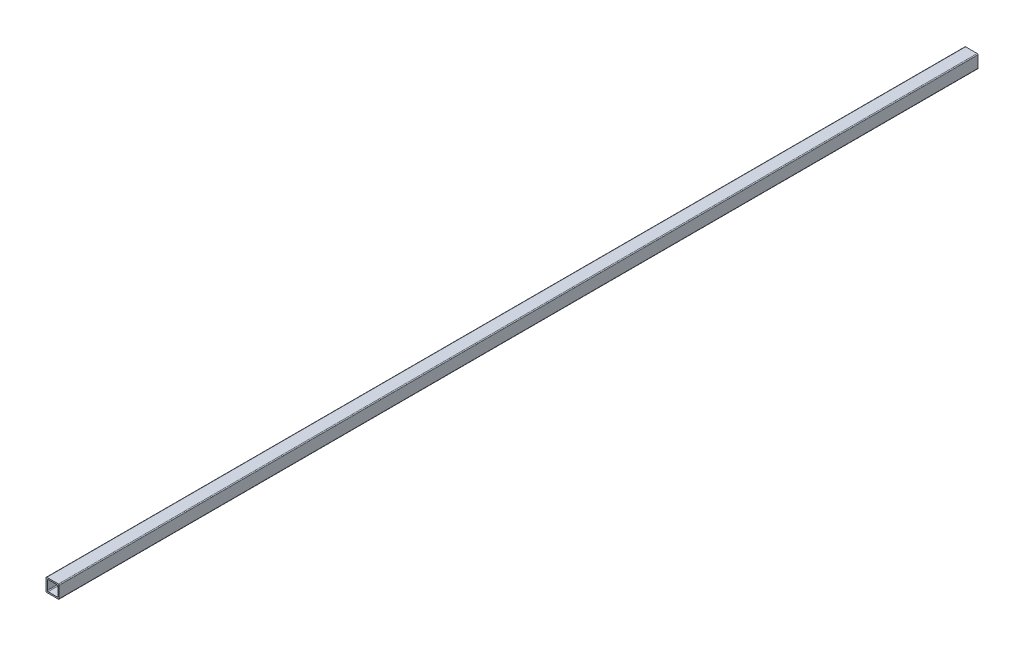
ISO-10303-21;
HEADER;
FILE_DESCRIPTION(('STEP AP214'),'2;1');
FILE_NAME('part.step','',(''),(''),'','','');
FILE_SCHEMA(('AUTOMOTIVE_DESIGN { 1 0 10303 214 1 1 1 1 }'));
ENDSEC;
DATA;
#1=APPLICATION_CONTEXT('core data for automotive mechanical design processes');
#2=APPLICATION_PROTOCOL_DEFINITION('international standard','automotive_design',2000,#1);
#3=PRODUCT_CONTEXT('',#1,'mechanical');
#4=PRODUCT('Part','Part','',(#3));
#5=PRODUCT_RELATED_PRODUCT_CATEGORY('part','',(#4));
#6=PRODUCT_DEFINITION_FORMATION('','',#4);
#7=PRODUCT_DEFINITION_CONTEXT('part definition',#1,'design');
#8=PRODUCT_DEFINITION('design','',#6,#7);
#9=PRODUCT_DEFINITION_SHAPE('','',#8);
#10=(LENGTH_UNIT() NAMED_UNIT(*) SI_UNIT(.MILLI.,.METRE.));
#11=(NAMED_UNIT(*) PLANE_ANGLE_UNIT() SI_UNIT($,.RADIAN.));
#12=(NAMED_UNIT(*) SI_UNIT($,.STERADIAN.) SOLID_ANGLE_UNIT());
#13=UNCERTAINTY_MEASURE_WITH_UNIT(LENGTH_MEASURE(1.E-05),#10,'distance_accuracy_value','');
#14=(GEOMETRIC_REPRESENTATION_CONTEXT(3) GLOBAL_UNCERTAINTY_ASSIGNED_CONTEXT((#13)) GLOBAL_UNIT_ASSIGNED_CONTEXT((#10,
#11,#12)) REPRESENTATION_CONTEXT('',''));
#15=CARTESIAN_POINT('',(0.,0.,0.));
#16=DIRECTION('',(0.,0.,1.));
#17=DIRECTION('',(1.,0.,0.));
#18=AXIS2_PLACEMENT_3D('',#15,#16,#17);
#19=CARTESIAN_POINT('',(0.,0.,275.));
#20=DIRECTION('',(0.,0.,1.));
#21=DIRECTION('',(1.,0.,0.));
#22=AXIS2_PLACEMENT_3D('',#19,#20,#21);
#23=PLANE('',#22);
#24=DIRECTION('',(0.,1.,0.));
#25=VECTOR('',#24,1.);
#26=CARTESIAN_POINT('',(3.95,3.95,275.));
#27=LINE('',#26,#25);
#28=CARTESIAN_POINT('',(3.95,-3.45,275.));
#29=VERTEX_POINT('',#28);
#30=CARTESIAN_POINT('',(3.95,3.45,275.));
#31=VERTEX_POINT('',#30);
#32=EDGE_CURVE('E199',#29,#31,#27,.T.);
#33=ORIENTED_EDGE('',*,*,#32,.T.);
#34=CARTESIAN_POINT('',(3.45,3.45,275.));
#35=DIRECTION('',(0.,0.,1.));
#36=DIRECTION('',(1.,0.,0.));
#37=AXIS2_PLACEMENT_3D('',#34,#35,#36);
#38=CIRCLE('',#37,0.5);
#39=CARTESIAN_POINT('',(3.45,3.95,275.));
#40=VERTEX_POINT('',#39);
#41=EDGE_CURVE('E224',#31,#40,#38,.T.);
#42=ORIENTED_EDGE('',*,*,#41,.T.);
#43=DIRECTION('',(-1.,0.,0.));
#44=VECTOR('',#43,1.);
#45=CARTESIAN_POINT('',(-3.95,3.95,275.));
#46=LINE('',#45,#44);
#47=CARTESIAN_POINT('',(-3.45,3.95,275.));
#48=VERTEX_POINT('',#47);
#49=EDGE_CURVE('E175',#40,#48,#46,.T.);
#50=ORIENTED_EDGE('',*,*,#49,.T.);
#51=CARTESIAN_POINT('',(-3.45,3.45,275.));
#52=DIRECTION('',(0.,0.,1.));
#53=DIRECTION('',(1.,0.,0.));
#54=AXIS2_PLACEMENT_3D('',#51,#52,#53);
#55=CIRCLE('',#54,0.5);
#56=CARTESIAN_POINT('',(-3.95,3.45,275.));
#57=VERTEX_POINT('',#56);
#58=EDGE_CURVE('E215',#48,#57,#55,.T.);
#59=ORIENTED_EDGE('',*,*,#58,.T.);
#60=DIRECTION('',(0.,-1.,0.));
#61=VECTOR('',#60,1.);
#62=CARTESIAN_POINT('',(-3.95,3.95,275.));
#63=LINE('',#62,#61);
#64=CARTESIAN_POINT('',(-3.95,-3.45,275.));
#65=VERTEX_POINT('',#64);
#66=EDGE_CURVE('E333',#57,#65,#63,.T.);
#67=ORIENTED_EDGE('',*,*,#66,.T.);
#68=CARTESIAN_POINT('',(-3.45,-3.45,275.));
#69=DIRECTION('',(0.,0.,1.));
#70=DIRECTION('',(1.,0.,0.));
#71=AXIS2_PLACEMENT_3D('',#68,#69,#70);
#72=CIRCLE('',#71,0.5);
#73=CARTESIAN_POINT('',(-3.45,-3.95,275.));
#74=VERTEX_POINT('',#73);
#75=EDGE_CURVE('E218',#65,#74,#72,.T.);
#76=ORIENTED_EDGE('',*,*,#75,.T.);
#77=DIRECTION('',(1.,0.,0.));
#78=VECTOR('',#77,1.);
#79=CARTESIAN_POINT('',(-3.95,-3.95,275.));
#80=LINE('',#79,#78);
#81=CARTESIAN_POINT('',(3.45,-3.95,275.));
#82=VERTEX_POINT('',#81);
#83=EDGE_CURVE('E201',#74,#82,#80,.T.);
#84=ORIENTED_EDGE('',*,*,#83,.T.);
#85=CARTESIAN_POINT('',(3.45,-3.45,275.));
#86=DIRECTION('',(0.,0.,1.));
#87=DIRECTION('',(1.,0.,0.));
#88=AXIS2_PLACEMENT_3D('',#85,#86,#87);
#89=CIRCLE('',#88,0.5);
#90=EDGE_CURVE('E221',#82,#29,#89,.T.);
#91=ORIENTED_EDGE('',*,*,#90,.T.);
#92=EDGE_LOOP('',(#33,#42,#50,#59,#67,#76,#84,#91));
#93=FACE_BOUND('',#92,.T.);
#94=DIRECTION('',(-1.,0.,0.));
#95=VECTOR('',#94,1.);
#96=CARTESIAN_POINT('',(-3.15,3.15,275.));
#97=LINE('',#96,#95);
#98=CARTESIAN_POINT('',(2.65,3.15,275.));
#99=VERTEX_POINT('',#98);
#100=CARTESIAN_POINT('',(-2.65,3.15,275.));
#101=VERTEX_POINT('',#100);
#102=EDGE_CURVE('E302',#99,#101,#97,.T.);
#103=ORIENTED_EDGE('',*,*,#102,.F.);
#104=CARTESIAN_POINT('',(2.65,2.65,275.));
#105=DIRECTION('',(0.,0.,1.));
#106=DIRECTION('',(1.,0.,0.));
#107=AXIS2_PLACEMENT_3D('',#104,#105,#106);
#108=CIRCLE('',#107,0.5);
#109=CARTESIAN_POINT('',(3.15,2.65,275.));
#110=VERTEX_POINT('',#109);
#111=EDGE_CURVE('E271',#99,#110,#108,.F.);
#112=ORIENTED_EDGE('',*,*,#111,.T.);
#113=DIRECTION('',(0.,1.,0.));
#114=VECTOR('',#113,1.);
#115=CARTESIAN_POINT('',(3.15,3.15,275.));
#116=LINE('',#115,#114);
#117=CARTESIAN_POINT('',(3.15,-2.65,275.));
#118=VERTEX_POINT('',#117);
#119=EDGE_CURVE('E309',#118,#110,#116,.T.);
#120=ORIENTED_EDGE('',*,*,#119,.F.);
#121=CARTESIAN_POINT('',(2.65,-2.65,275.));
#122=DIRECTION('',(0.,0.,1.));
#123=DIRECTION('',(1.,0.,0.));
#124=AXIS2_PLACEMENT_3D('',#121,#122,#123);
#125=CIRCLE('',#124,0.5);
#126=CARTESIAN_POINT('',(2.65,-3.15,275.));
#127=VERTEX_POINT('',#126);
#128=EDGE_CURVE('E277',#118,#127,#125,.F.);
#129=ORIENTED_EDGE('',*,*,#128,.T.);
#130=DIRECTION('',(1.,0.,0.));
#131=VECTOR('',#130,1.);
#132=CARTESIAN_POINT('',(-3.15,-3.15,275.));
#133=LINE('',#132,#131);
#134=CARTESIAN_POINT('',(-2.65,-3.15,275.));
#135=VERTEX_POINT('',#134);
#136=EDGE_CURVE('E192',#135,#127,#133,.T.);
#137=ORIENTED_EDGE('',*,*,#136,.F.);
#138=CARTESIAN_POINT('',(-2.65,-2.65,275.));
#139=DIRECTION('',(0.,0.,1.));
#140=DIRECTION('',(1.,0.,0.));
#141=AXIS2_PLACEMENT_3D('',#138,#139,#140);
#142=CIRCLE('',#141,0.5);
#143=CARTESIAN_POINT('',(-3.15,-2.65,275.));
#144=VERTEX_POINT('',#143);
#145=EDGE_CURVE('E55',#135,#144,#142,.F.);
#146=ORIENTED_EDGE('',*,*,#145,.T.);
#147=DIRECTION('',(0.,-1.,0.));
#148=VECTOR('',#147,1.);
#149=CARTESIAN_POINT('',(-3.15,3.15,275.));
#150=LINE('',#149,#148);
#151=CARTESIAN_POINT('',(-3.15,2.65,275.));
#152=VERTEX_POINT('',#151);
#153=EDGE_CURVE('E304',#152,#144,#150,.T.);
#154=ORIENTED_EDGE('',*,*,#153,.F.);
#155=CARTESIAN_POINT('',(-2.65,2.65,275.));
#156=DIRECTION('',(0.,0.,1.));
#157=DIRECTION('',(1.,0.,0.));
#158=AXIS2_PLACEMENT_3D('',#155,#156,#157);
#159=CIRCLE('',#158,0.5);
#160=EDGE_CURVE('E11',#152,#101,#159,.F.);
#161=ORIENTED_EDGE('',*,*,#160,.T.);
#162=EDGE_LOOP('',(#103,#112,#120,#129,#137,#146,#154,#161));
#163=FACE_BOUND('',#162,.T.);
#164=ADVANCED_FACE('F39',(#93,#163),#23,.T.);
#165=CARTESIAN_POINT('',(0.,0.,-275.));
#166=DIRECTION('',(0.,0.,1.));
#167=DIRECTION('',(1.,0.,0.));
#168=AXIS2_PLACEMENT_3D('',#165,#166,#167);
#169=PLANE('',#168);
#170=DIRECTION('',(-1.,0.,0.));
#171=VECTOR('',#170,1.);
#172=CARTESIAN_POINT('',(-3.95,3.95,-275.));
#173=LINE('',#172,#171);
#174=CARTESIAN_POINT('',(3.45,3.95,-275.));
#175=VERTEX_POINT('',#174);
#176=CARTESIAN_POINT('',(-3.45,3.95,-275.));
#177=VERTEX_POINT('',#176);
#178=EDGE_CURVE('E172',#175,#177,#173,.T.);
#179=ORIENTED_EDGE('',*,*,#178,.F.);
#180=CARTESIAN_POINT('',(3.45,3.45,-275.));
#181=DIRECTION('',(0.,0.,1.));
#182=DIRECTION('',(1.,0.,0.));
#183=AXIS2_PLACEMENT_3D('',#180,#181,#182);
#184=CIRCLE('',#183,0.5);
#185=CARTESIAN_POINT('',(3.95,3.45,-275.));
#186=VERTEX_POINT('',#185);
#187=EDGE_CURVE('E154',#175,#186,#184,.F.);
#188=ORIENTED_EDGE('',*,*,#187,.T.);
#189=DIRECTION('',(0.,1.,0.));
#190=VECTOR('',#189,1.);
#191=CARTESIAN_POINT('',(3.95,3.95,-275.));
#192=LINE('',#191,#190);
#193=CARTESIAN_POINT('',(3.95,-3.45,-275.));
#194=VERTEX_POINT('',#193);
#195=EDGE_CURVE('E185',#194,#186,#192,.T.);
#196=ORIENTED_EDGE('',*,*,#195,.F.);
#197=CARTESIAN_POINT('',(3.45,-3.45,-275.));
#198=DIRECTION('',(0.,0.,1.));
#199=DIRECTION('',(1.,0.,0.));
#200=AXIS2_PLACEMENT_3D('',#197,#198,#199);
#201=CIRCLE('',#200,0.5);
#202=CARTESIAN_POINT('',(3.45,-3.95,-275.));
#203=VERTEX_POINT('',#202);
#204=EDGE_CURVE('E166',#194,#203,#201,.F.);
#205=ORIENTED_EDGE('',*,*,#204,.T.);
#206=DIRECTION('',(1.,0.,0.));
#207=VECTOR('',#206,1.);
#208=CARTESIAN_POINT('',(-3.95,-3.95,-275.));
#209=LINE('',#208,#207);
#210=CARTESIAN_POINT('',(-3.45,-3.95,-275.));
#211=VERTEX_POINT('',#210);
#212=EDGE_CURVE('E190',#211,#203,#209,.T.);
#213=ORIENTED_EDGE('',*,*,#212,.F.);
#214=CARTESIAN_POINT('',(-3.45,-3.45,-275.));
#215=DIRECTION('',(0.,0.,1.));
#216=DIRECTION('',(1.,0.,0.));
#217=AXIS2_PLACEMENT_3D('',#214,#215,#216);
#218=CIRCLE('',#217,0.5);
#219=CARTESIAN_POINT('',(-3.95,-3.45,-275.));
#220=VERTEX_POINT('',#219);
#221=EDGE_CURVE('E205',#211,#220,#218,.F.);
#222=ORIENTED_EDGE('',*,*,#221,.T.);
#223=DIRECTION('',(0.,-1.,0.));
#224=VECTOR('',#223,1.);
#225=CARTESIAN_POINT('',(-3.95,3.95,-275.));
#226=LINE('',#225,#224);
#227=CARTESIAN_POINT('',(-3.95,3.45,-275.));
#228=VERTEX_POINT('',#227);
#229=EDGE_CURVE('E184',#228,#220,#226,.T.);
#230=ORIENTED_EDGE('',*,*,#229,.F.);
#231=CARTESIAN_POINT('',(-3.45,3.45,-275.));
#232=DIRECTION('',(0.,0.,1.));
#233=DIRECTION('',(1.,0.,0.));
#234=AXIS2_PLACEMENT_3D('',#231,#232,#233);
#235=CIRCLE('',#234,0.5);
#236=EDGE_CURVE('E177',#228,#177,#235,.F.);
#237=ORIENTED_EDGE('',*,*,#236,.T.);
#238=EDGE_LOOP('',(#179,#188,#196,#205,#213,#222,#230,#237));
#239=FACE_BOUND('',#238,.T.);
#240=DIRECTION('',(1.,0.,0.));
#241=VECTOR('',#240,1.);
#242=CARTESIAN_POINT('',(-3.15,-3.15,-275.));
#243=LINE('',#242,#241);
#244=CARTESIAN_POINT('',(-2.65,-3.15,-275.));
#245=VERTEX_POINT('',#244);
#246=CARTESIAN_POINT('',(2.65,-3.15,-275.));
#247=VERTEX_POINT('',#246);
#248=EDGE_CURVE('E296',#245,#247,#243,.T.);
#249=ORIENTED_EDGE('',*,*,#248,.T.);
#250=CARTESIAN_POINT('',(2.65,-2.65,-275.));
#251=DIRECTION('',(0.,0.,1.));
#252=DIRECTION('',(1.,0.,0.));
#253=AXIS2_PLACEMENT_3D('',#250,#251,#252);
#254=CIRCLE('',#253,0.5);
#255=CARTESIAN_POINT('',(3.15,-2.65,-275.));
#256=VERTEX_POINT('',#255);
#257=EDGE_CURVE('E274',#247,#256,#254,.T.);
#258=ORIENTED_EDGE('',*,*,#257,.T.);
#259=DIRECTION('',(0.,1.,0.));
#260=VECTOR('',#259,1.);
#261=CARTESIAN_POINT('',(3.15,3.15,-275.));
#262=LINE('',#261,#260);
#263=CARTESIAN_POINT('',(3.15,2.65,-275.));
#264=VERTEX_POINT('',#263);
#265=EDGE_CURVE('E320',#256,#264,#262,.T.);
#266=ORIENTED_EDGE('',*,*,#265,.T.);
#267=CARTESIAN_POINT('',(2.65,2.65,-275.));
#268=DIRECTION('',(0.,0.,1.));
#269=DIRECTION('',(1.,0.,0.));
#270=AXIS2_PLACEMENT_3D('',#267,#268,#269);
#271=CIRCLE('',#270,0.5);
#272=CARTESIAN_POINT('',(2.65,3.15,-275.));
#273=VERTEX_POINT('',#272);
#274=EDGE_CURVE('E268',#264,#273,#271,.T.);
#275=ORIENTED_EDGE('',*,*,#274,.T.);
#276=DIRECTION('',(-1.,0.,0.));
#277=VECTOR('',#276,1.);
#278=CARTESIAN_POINT('',(-3.15,3.15,-275.));
#279=LINE('',#278,#277);
#280=CARTESIAN_POINT('',(-2.65,3.15,-275.));
#281=VERTEX_POINT('',#280);
#282=EDGE_CURVE('E290',#273,#281,#279,.T.);
#283=ORIENTED_EDGE('',*,*,#282,.T.);
#284=CARTESIAN_POINT('',(-2.65,2.65,-275.));
#285=DIRECTION('',(0.,0.,1.));
#286=DIRECTION('',(1.,0.,0.));
#287=AXIS2_PLACEMENT_3D('',#284,#285,#286);
#288=CIRCLE('',#287,0.5);
#289=CARTESIAN_POINT('',(-3.15,2.65,-275.));
#290=VERTEX_POINT('',#289);
#291=EDGE_CURVE('E48',#281,#290,#288,.T.);
#292=ORIENTED_EDGE('',*,*,#291,.T.);
#293=DIRECTION('',(0.,-1.,0.));
#294=VECTOR('',#293,1.);
#295=CARTESIAN_POINT('',(-3.15,3.15,-275.));
#296=LINE('',#295,#294);
#297=CARTESIAN_POINT('',(-3.15,-2.65,-275.));
#298=VERTEX_POINT('',#297);
#299=EDGE_CURVE('E288',#290,#298,#296,.T.);
#300=ORIENTED_EDGE('',*,*,#299,.T.);
#301=CARTESIAN_POINT('',(-2.65,-2.65,-275.));
#302=DIRECTION('',(0.,0.,1.));
#303=DIRECTION('',(1.,0.,0.));
#304=AXIS2_PLACEMENT_3D('',#301,#302,#303);
#305=CIRCLE('',#304,0.5);
#306=EDGE_CURVE('E280',#298,#245,#305,.T.);
#307=ORIENTED_EDGE('',*,*,#306,.T.);
#308=EDGE_LOOP('',(#249,#258,#266,#275,#283,#292,#300,#307));
#309=FACE_BOUND('',#308,.T.);
#310=ADVANCED_FACE('F180',(#239,#309),#169,.F.);
#311=CARTESIAN_POINT('',(3.95,3.95,275.));
#312=DIRECTION('',(-1.,0.,0.));
#313=DIRECTION('',(0.,0.,1.));
#314=AXIS2_PLACEMENT_3D('',#311,#312,#313);
#315=PLANE('',#314);
#316=ORIENTED_EDGE('',*,*,#195,.T.);
#317=DIRECTION('',(0.,0.,-1.));
#318=VECTOR('',#317,1.);
#319=CARTESIAN_POINT('',(3.95,3.45,275.));
#320=LINE('',#319,#318);
#321=EDGE_CURVE('E159',#186,#31,#320,.F.);
#322=ORIENTED_EDGE('',*,*,#321,.T.);
#323=ORIENTED_EDGE('',*,*,#32,.F.);
#324=DIRECTION('',(0.,0.,-1.));
#325=VECTOR('',#324,1.);
#326=CARTESIAN_POINT('',(3.95,-3.45,275.));
#327=LINE('',#326,#325);
#328=EDGE_CURVE('E165',#29,#194,#327,.T.);
#329=ORIENTED_EDGE('',*,*,#328,.T.);
#330=EDGE_LOOP('',(#316,#322,#323,#329));
#331=FACE_BOUND('',#330,.T.);
#332=ADVANCED_FACE('F350',(#331),#315,.F.);
#333=CARTESIAN_POINT('',(-3.95,3.95,275.));
#334=DIRECTION('',(0.,-1.,0.));
#335=DIRECTION('',(0.,0.,-1.));
#336=AXIS2_PLACEMENT_3D('',#333,#334,#335);
#337=PLANE('',#336);
#338=ORIENTED_EDGE('',*,*,#49,.F.);
#339=DIRECTION('',(0.,0.,-1.));
#340=VECTOR('',#339,1.);
#341=CARTESIAN_POINT('',(3.45,3.95,275.));
#342=LINE('',#341,#340);
#343=EDGE_CURVE('E158',#40,#175,#342,.T.);
#344=ORIENTED_EDGE('',*,*,#343,.T.);
#345=ORIENTED_EDGE('',*,*,#178,.T.);
#346=DIRECTION('',(0.,0.,-1.));
#347=VECTOR('',#346,1.);
#348=CARTESIAN_POINT('',(-3.45,3.95,275.));
#349=LINE('',#348,#347);
#350=EDGE_CURVE('E178',#177,#48,#349,.F.);
#351=ORIENTED_EDGE('',*,*,#350,.T.);
#352=EDGE_LOOP('',(#338,#344,#345,#351));
#353=FACE_BOUND('',#352,.T.);
#354=ADVANCED_FACE('F171',(#353),#337,.F.);
#355=CARTESIAN_POINT('',(-3.95,3.95,275.));
#356=DIRECTION('',(1.,0.,0.));
#357=DIRECTION('',(0.,0.,-1.));
#358=AXIS2_PLACEMENT_3D('',#355,#356,#357);
#359=PLANE('',#358);
#360=ORIENTED_EDGE('',*,*,#229,.T.);
#361=DIRECTION('',(0.,0.,-1.));
#362=VECTOR('',#361,1.);
#363=CARTESIAN_POINT('',(-3.95,-3.45,275.));
#364=LINE('',#363,#362);
#365=EDGE_CURVE('E259',#220,#65,#364,.F.);
#366=ORIENTED_EDGE('',*,*,#365,.T.);
#367=ORIENTED_EDGE('',*,*,#66,.F.);
#368=DIRECTION('',(0.,0.,-1.));
#369=VECTOR('',#368,1.);
#370=CARTESIAN_POINT('',(-3.95,3.45,275.));
#371=LINE('',#370,#369);
#372=EDGE_CURVE('E255',#57,#228,#371,.T.);
#373=ORIENTED_EDGE('',*,*,#372,.T.);
#374=EDGE_LOOP('',(#360,#366,#367,#373));
#375=FACE_BOUND('',#374,.T.);
#376=ADVANCED_FACE('F357',(#375),#359,.F.);
#377=CARTESIAN_POINT('',(-3.95,-3.95,275.));
#378=DIRECTION('',(0.,1.,0.));
#379=DIRECTION('',(0.,0.,1.));
#380=AXIS2_PLACEMENT_3D('',#377,#378,#379);
#381=PLANE('',#380);
#382=ORIENTED_EDGE('',*,*,#212,.T.);
#383=DIRECTION('',(0.,0.,-1.));
#384=VECTOR('',#383,1.);
#385=CARTESIAN_POINT('',(3.45,-3.95,275.));
#386=LINE('',#385,#384);
#387=EDGE_CURVE('E245',#203,#82,#386,.F.);
#388=ORIENTED_EDGE('',*,*,#387,.T.);
#389=ORIENTED_EDGE('',*,*,#83,.F.);
#390=DIRECTION('',(0.,0.,-1.));
#391=VECTOR('',#390,1.);
#392=CARTESIAN_POINT('',(-3.45,-3.95,275.));
#393=LINE('',#392,#391);
#394=EDGE_CURVE('E241',#74,#211,#393,.T.);
#395=ORIENTED_EDGE('',*,*,#394,.T.);
#396=EDGE_LOOP('',(#382,#388,#389,#395));
#397=FACE_BOUND('',#396,.T.);
#398=ADVANCED_FACE('F352',(#397),#381,.F.);
#399=CARTESIAN_POINT('',(3.15,3.15,275.));
#400=DIRECTION('',(-1.,0.,0.));
#401=DIRECTION('',(0.,0.,1.));
#402=AXIS2_PLACEMENT_3D('',#399,#400,#401);
#403=PLANE('',#402);
#404=ORIENTED_EDGE('',*,*,#119,.T.);
#405=DIRECTION('',(0.,0.,-1.));
#406=VECTOR('',#405,1.);
#407=CARTESIAN_POINT('',(3.15,2.65,-275.));
#408=LINE('',#407,#406);
#409=EDGE_CURVE('E230',#110,#264,#408,.T.);
#410=ORIENTED_EDGE('',*,*,#409,.T.);
#411=ORIENTED_EDGE('',*,*,#265,.F.);
#412=DIRECTION('',(0.,0.,-1.));
#413=VECTOR('',#412,1.);
#414=CARTESIAN_POINT('',(3.15,-2.65,275.));
#415=LINE('',#414,#413);
#416=EDGE_CURVE('E227',#256,#118,#415,.F.);
#417=ORIENTED_EDGE('',*,*,#416,.T.);
#418=EDGE_LOOP('',(#404,#410,#411,#417));
#419=FACE_BOUND('',#418,.T.);
#420=ADVANCED_FACE('F374',(#419),#403,.T.);
#421=CARTESIAN_POINT('',(-3.15,3.15,275.));
#422=DIRECTION('',(0.,-1.,0.));
#423=DIRECTION('',(0.,0.,-1.));
#424=AXIS2_PLACEMENT_3D('',#421,#422,#423);
#425=PLANE('',#424);
#426=ORIENTED_EDGE('',*,*,#282,.F.);
#427=DIRECTION('',(0.,0.,-1.));
#428=VECTOR('',#427,1.);
#429=CARTESIAN_POINT('',(2.65,3.15,275.));
#430=LINE('',#429,#428);
#431=EDGE_CURVE('E238',#273,#99,#430,.F.);
#432=ORIENTED_EDGE('',*,*,#431,.T.);
#433=ORIENTED_EDGE('',*,*,#102,.T.);
#434=DIRECTION('',(0.,0.,-1.));
#435=VECTOR('',#434,1.);
#436=CARTESIAN_POINT('',(-2.65,3.15,-275.));
#437=LINE('',#436,#435);
#438=EDGE_CURVE('E234',#101,#281,#437,.T.);
#439=ORIENTED_EDGE('',*,*,#438,.T.);
#440=EDGE_LOOP('',(#426,#432,#433,#439));
#441=FACE_BOUND('',#440,.T.);
#442=ADVANCED_FACE('F306',(#441),#425,.T.);
#443=CARTESIAN_POINT('',(-3.15,3.15,275.));
#444=DIRECTION('',(1.,0.,0.));
#445=DIRECTION('',(0.,0.,-1.));
#446=AXIS2_PLACEMENT_3D('',#443,#444,#445);
#447=PLANE('',#446);
#448=ORIENTED_EDGE('',*,*,#153,.T.);
#449=DIRECTION('',(0.,0.,-1.));
#450=VECTOR('',#449,1.);
#451=CARTESIAN_POINT('',(-3.15,-2.65,-275.));
#452=LINE('',#451,#450);
#453=EDGE_CURVE('E264',#144,#298,#452,.T.);
#454=ORIENTED_EDGE('',*,*,#453,.T.);
#455=ORIENTED_EDGE('',*,*,#299,.F.);
#456=DIRECTION('',(0.,0.,-1.));
#457=VECTOR('',#456,1.);
#458=CARTESIAN_POINT('',(-3.15,2.65,275.));
#459=LINE('',#458,#457);
#460=EDGE_CURVE('E62',#290,#152,#459,.F.);
#461=ORIENTED_EDGE('',*,*,#460,.T.);
#462=EDGE_LOOP('',(#448,#454,#455,#461));
#463=FACE_BOUND('',#462,.T.);
#464=ADVANCED_FACE('F293',(#463),#447,.T.);
#465=CARTESIAN_POINT('',(-3.15,-3.15,275.));
#466=DIRECTION('',(0.,1.,0.));
#467=DIRECTION('',(0.,0.,1.));
#468=AXIS2_PLACEMENT_3D('',#465,#466,#467);
#469=PLANE('',#468);
#470=ORIENTED_EDGE('',*,*,#136,.T.);
#471=DIRECTION('',(0.,0.,-1.));
#472=VECTOR('',#471,1.);
#473=CARTESIAN_POINT('',(2.65,-3.15,-275.));
#474=LINE('',#473,#472);
#475=EDGE_CURVE('E251',#127,#247,#474,.T.);
#476=ORIENTED_EDGE('',*,*,#475,.T.);
#477=ORIENTED_EDGE('',*,*,#248,.F.);
#478=DIRECTION('',(0.,0.,-1.));
#479=VECTOR('',#478,1.);
#480=CARTESIAN_POINT('',(-2.65,-3.15,275.));
#481=LINE('',#480,#479);
#482=EDGE_CURVE('E248',#245,#135,#481,.F.);
#483=ORIENTED_EDGE('',*,*,#482,.T.);
#484=EDGE_LOOP('',(#470,#476,#477,#483));
#485=FACE_BOUND('',#484,.T.);
#486=ADVANCED_FACE('F388',(#485),#469,.T.);
#487=CARTESIAN_POINT('',(3.45,3.45,275.));
#488=DIRECTION('',(0.,0.,-1.));
#489=DIRECTION('',(-1.,0.,0.));
#490=AXIS2_PLACEMENT_3D('',#487,#488,#489);
#491=CYLINDRICAL_SURFACE('',#490,0.5);
#492=ORIENTED_EDGE('',*,*,#41,.F.);
#493=ORIENTED_EDGE('',*,*,#321,.F.);
#494=ORIENTED_EDGE('',*,*,#187,.F.);
#495=ORIENTED_EDGE('',*,*,#343,.F.);
#496=EDGE_LOOP('',(#492,#493,#494,#495));
#497=FACE_BOUND('',#496,.T.);
#498=ADVANCED_FACE('F157',(#497),#491,.T.);
#499=CARTESIAN_POINT('',(2.65,2.65,275.));
#500=DIRECTION('',(0.,0.,1.));
#501=DIRECTION('',(1.,0.,0.));
#502=AXIS2_PLACEMENT_3D('',#499,#500,#501);
#503=CYLINDRICAL_SURFACE('',#502,0.5);
#504=ORIENTED_EDGE('',*,*,#111,.F.);
#505=ORIENTED_EDGE('',*,*,#431,.F.);
#506=ORIENTED_EDGE('',*,*,#274,.F.);
#507=ORIENTED_EDGE('',*,*,#409,.F.);
#508=EDGE_LOOP('',(#504,#505,#506,#507));
#509=FACE_BOUND('',#508,.T.);
#510=ADVANCED_FACE('F387',(#509),#503,.F.);
#511=CARTESIAN_POINT('',(3.45,-3.45,275.));
#512=DIRECTION('',(0.,0.,-1.));
#513=DIRECTION('',(-1.,0.,0.));
#514=AXIS2_PLACEMENT_3D('',#511,#512,#513);
#515=CYLINDRICAL_SURFACE('',#514,0.5);
#516=ORIENTED_EDGE('',*,*,#90,.F.);
#517=ORIENTED_EDGE('',*,*,#387,.F.);
#518=ORIENTED_EDGE('',*,*,#204,.F.);
#519=ORIENTED_EDGE('',*,*,#328,.F.);
#520=EDGE_LOOP('',(#516,#517,#518,#519));
#521=FACE_BOUND('',#520,.T.);
#522=ADVANCED_FACE('F348',(#521),#515,.T.);
#523=CARTESIAN_POINT('',(2.65,-2.65,275.));
#524=DIRECTION('',(0.,0.,1.));
#525=DIRECTION('',(1.,0.,0.));
#526=AXIS2_PLACEMENT_3D('',#523,#524,#525);
#527=CYLINDRICAL_SURFACE('',#526,0.5);
#528=ORIENTED_EDGE('',*,*,#128,.F.);
#529=ORIENTED_EDGE('',*,*,#416,.F.);
#530=ORIENTED_EDGE('',*,*,#257,.F.);
#531=ORIENTED_EDGE('',*,*,#475,.F.);
#532=EDGE_LOOP('',(#528,#529,#530,#531));
#533=FACE_BOUND('',#532,.T.);
#534=ADVANCED_FACE('F394',(#533),#527,.F.);
#535=CARTESIAN_POINT('',(-3.45,-3.45,275.));
#536=DIRECTION('',(0.,0.,-1.));
#537=DIRECTION('',(-1.,0.,0.));
#538=AXIS2_PLACEMENT_3D('',#535,#536,#537);
#539=CYLINDRICAL_SURFACE('',#538,0.5);
#540=ORIENTED_EDGE('',*,*,#75,.F.);
#541=ORIENTED_EDGE('',*,*,#365,.F.);
#542=ORIENTED_EDGE('',*,*,#221,.F.);
#543=ORIENTED_EDGE('',*,*,#394,.F.);
#544=EDGE_LOOP('',(#540,#541,#542,#543));
#545=FACE_BOUND('',#544,.T.);
#546=ADVANCED_FACE('F354',(#545),#539,.T.);
#547=CARTESIAN_POINT('',(-2.65,-2.65,275.));
#548=DIRECTION('',(0.,0.,1.));
#549=DIRECTION('',(1.,0.,0.));
#550=AXIS2_PLACEMENT_3D('',#547,#548,#549);
#551=CYLINDRICAL_SURFACE('',#550,0.5);
#552=ORIENTED_EDGE('',*,*,#145,.F.);
#553=ORIENTED_EDGE('',*,*,#482,.F.);
#554=ORIENTED_EDGE('',*,*,#306,.F.);
#555=ORIENTED_EDGE('',*,*,#453,.F.);
#556=EDGE_LOOP('',(#552,#553,#554,#555));
#557=FACE_BOUND('',#556,.T.);
#558=ADVANCED_FACE('F366',(#557),#551,.F.);
#559=CARTESIAN_POINT('',(-2.65,2.65,275.));
#560=DIRECTION('',(0.,0.,1.));
#561=DIRECTION('',(1.,0.,0.));
#562=AXIS2_PLACEMENT_3D('',#559,#560,#561);
#563=CYLINDRICAL_SURFACE('',#562,0.5);
#564=ORIENTED_EDGE('',*,*,#160,.F.);
#565=ORIENTED_EDGE('',*,*,#460,.F.);
#566=ORIENTED_EDGE('',*,*,#291,.F.);
#567=ORIENTED_EDGE('',*,*,#438,.F.);
#568=EDGE_LOOP('',(#564,#565,#566,#567));
#569=FACE_BOUND('',#568,.T.);
#570=ADVANCED_FACE('F299',(#569),#563,.F.);
#571=CARTESIAN_POINT('',(-3.45,3.45,275.));
#572=DIRECTION('',(0.,0.,-1.));
#573=DIRECTION('',(-1.,0.,0.));
#574=AXIS2_PLACEMENT_3D('',#571,#572,#573);
#575=CYLINDRICAL_SURFACE('',#574,0.5);
#576=ORIENTED_EDGE('',*,*,#58,.F.);
#577=ORIENTED_EDGE('',*,*,#350,.F.);
#578=ORIENTED_EDGE('',*,*,#236,.F.);
#579=ORIENTED_EDGE('',*,*,#372,.F.);
#580=EDGE_LOOP('',(#576,#577,#578,#579));
#581=FACE_BOUND('',#580,.T.);
#582=ADVANCED_FACE('F41',(#581),#575,.T.);
#583=CLOSED_SHELL('',(#164,#310,#332,#354,#376,#398,#420,#442,#464,#486,#498,#510,#522,#534,
#546,#558,#570,#582));
#584=MANIFOLD_SOLID_BREP('B2',#583);
#585=ADVANCED_BREP_SHAPE_REPRESENTATION('',(#18,#584),#14);
#586=SHAPE_DEFINITION_REPRESENTATION(#9,#585);
ENDSEC;
END-ISO-10303-21;
